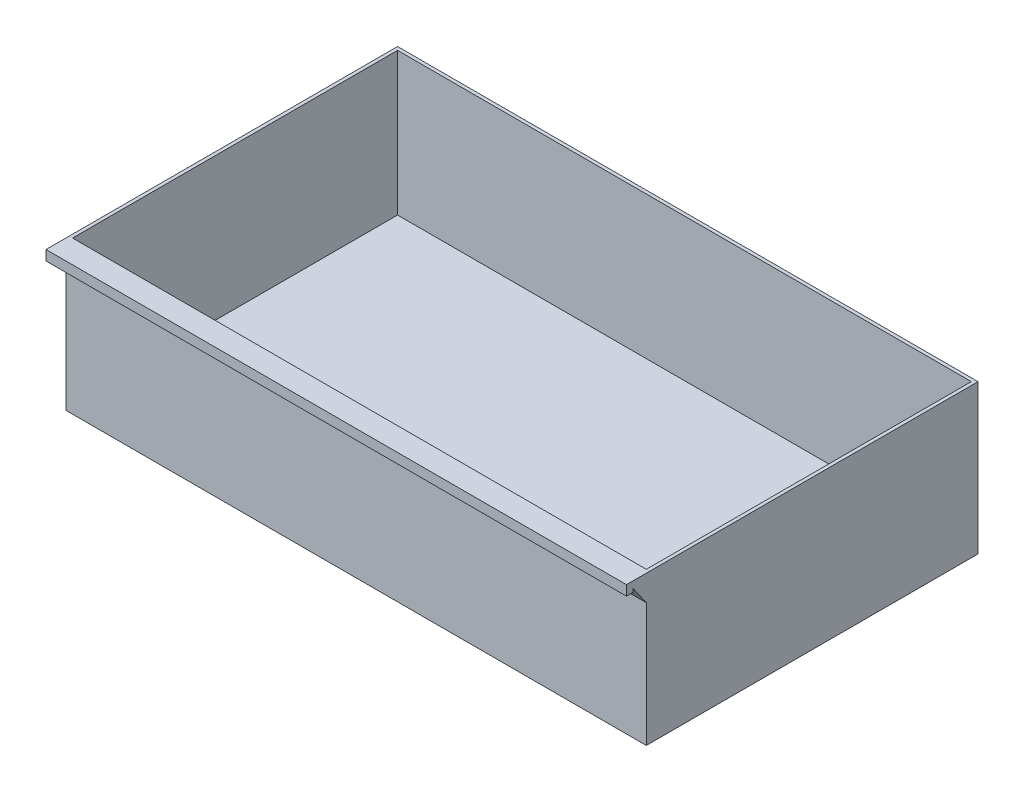
ISO-10303-21;
HEADER;
FILE_DESCRIPTION(('STEP AP214'),'2;1');
FILE_NAME('part.step','',(''),(''),'','','');
FILE_SCHEMA(('AUTOMOTIVE_DESIGN { 1 0 10303 214 1 1 1 1 }'));
ENDSEC;
DATA;
#1=APPLICATION_CONTEXT('core data for automotive mechanical design processes');
#2=APPLICATION_PROTOCOL_DEFINITION('international standard','automotive_design',2000,#1);
#3=PRODUCT_CONTEXT('',#1,'mechanical');
#4=PRODUCT('Part','Part','',(#3));
#5=PRODUCT_RELATED_PRODUCT_CATEGORY('part','',(#4));
#6=PRODUCT_DEFINITION_FORMATION('','',#4);
#7=PRODUCT_DEFINITION_CONTEXT('part definition',#1,'design');
#8=PRODUCT_DEFINITION('design','',#6,#7);
#9=PRODUCT_DEFINITION_SHAPE('','',#8);
#10=(LENGTH_UNIT() NAMED_UNIT(*) SI_UNIT(.MILLI.,.METRE.));
#11=(NAMED_UNIT(*) PLANE_ANGLE_UNIT() SI_UNIT($,.RADIAN.));
#12=(NAMED_UNIT(*) SI_UNIT($,.STERADIAN.) SOLID_ANGLE_UNIT());
#13=UNCERTAINTY_MEASURE_WITH_UNIT(LENGTH_MEASURE(1.E-05),#10,'distance_accuracy_value','');
#14=(GEOMETRIC_REPRESENTATION_CONTEXT(3) GLOBAL_UNCERTAINTY_ASSIGNED_CONTEXT((#13)) GLOBAL_UNIT_ASSIGNED_CONTEXT((#10,
#11,#12)) REPRESENTATION_CONTEXT('',''));
#15=CARTESIAN_POINT('',(0.,0.,0.));
#16=DIRECTION('',(0.,0.,1.));
#17=DIRECTION('',(1.,0.,0.));
#18=AXIS2_PLACEMENT_3D('',#15,#16,#17);
#19=CARTESIAN_POINT('',(-111.125,57.15,-63.5));
#20=DIRECTION('',(1.,0.,0.));
#21=DIRECTION('',(0.,0.,-1.));
#22=AXIS2_PLACEMENT_3D('',#19,#20,#21);
#23=PLANE('',#22);
#24=DIRECTION('',(0.,0.,1.));
#25=VECTOR('',#24,1.);
#26=CARTESIAN_POINT('',(-111.125,0.,-63.5));
#27=LINE('',#26,#25);
#28=CARTESIAN_POINT('',(-111.125,0.,-63.5));
#29=VERTEX_POINT('',#28);
#30=CARTESIAN_POINT('',(-111.125,0.,63.5));
#31=VERTEX_POINT('',#30);
#32=EDGE_CURVE('E195',#29,#31,#27,.T.);
#33=ORIENTED_EDGE('',*,*,#32,.T.);
#34=DIRECTION('',(0.,-1.,0.));
#35=VECTOR('',#34,1.);
#36=CARTESIAN_POINT('',(-111.125,57.15,63.5));
#37=LINE('',#36,#35);
#38=CARTESIAN_POINT('',(-111.125,47.35500812575,63.5));
#39=VERTEX_POINT('',#38);
#40=EDGE_CURVE('E11',#39,#31,#37,.T.);
#41=ORIENTED_EDGE('',*,*,#40,.F.);
#42=DIRECTION('',(0.,0.819152044288995,0.573576436351041));
#43=VECTOR('',#42,1.);
#44=CARTESIAN_POINT('',(-111.125,54.61,68.58));
#45=LINE('',#44,#43);
#46=CARTESIAN_POINT('',(-111.125,54.61,68.58));
#47=VERTEX_POINT('',#46);
#48=EDGE_CURVE('E59',#39,#47,#45,.T.);
#49=ORIENTED_EDGE('',*,*,#48,.T.);
#50=DIRECTION('',(0.,-1.,0.));
#51=VECTOR('',#50,1.);
#52=CARTESIAN_POINT('',(-111.125,53.34,68.58));
#53=LINE('',#52,#51);
#54=CARTESIAN_POINT('',(-111.125,53.34,68.58));
#55=VERTEX_POINT('',#54);
#56=EDGE_CURVE('E142',#47,#55,#53,.T.);
#57=ORIENTED_EDGE('',*,*,#56,.T.);
#58=DIRECTION('',(0.,0.,1.));
#59=VECTOR('',#58,1.);
#60=CARTESIAN_POINT('',(-111.125,53.34,71.12));
#61=LINE('',#60,#59);
#62=CARTESIAN_POINT('',(-111.125,53.34,71.12));
#63=VERTEX_POINT('',#62);
#64=EDGE_CURVE('E148',#55,#63,#61,.T.);
#65=ORIENTED_EDGE('',*,*,#64,.T.);
#66=DIRECTION('',(0.,1.,0.));
#67=VECTOR('',#66,1.);
#68=CARTESIAN_POINT('',(-111.125,57.15,71.12));
#69=LINE('',#68,#67);
#70=CARTESIAN_POINT('',(-111.125,57.15,71.12));
#71=VERTEX_POINT('',#70);
#72=EDGE_CURVE('E158',#63,#71,#69,.T.);
#73=ORIENTED_EDGE('',*,*,#72,.T.);
#74=DIRECTION('',(0.,0.,1.));
#75=VECTOR('',#74,1.);
#76=CARTESIAN_POINT('',(-111.125,57.15,-63.5));
#77=LINE('',#76,#75);
#78=CARTESIAN_POINT('',(-111.125,57.15,-63.5));
#79=VERTEX_POINT('',#78);
#80=EDGE_CURVE('E201',#79,#71,#77,.T.);
#81=ORIENTED_EDGE('',*,*,#80,.F.);
#82=DIRECTION('',(0.,-1.,0.));
#83=VECTOR('',#82,1.);
#84=CARTESIAN_POINT('',(-111.125,57.15,-63.5));
#85=LINE('',#84,#83);
#86=EDGE_CURVE('E208',#79,#29,#85,.T.);
#87=ORIENTED_EDGE('',*,*,#86,.T.);
#88=EDGE_LOOP('',(#33,#41,#49,#57,#65,#73,#81,#87));
#89=FACE_BOUND('',#88,.T.);
#90=ADVANCED_FACE('F45',(#89),#23,.F.);
#91=CARTESIAN_POINT('',(111.125,57.15,63.5));
#92=DIRECTION('',(0.,0.,-1.));
#93=DIRECTION('',(-1.,0.,0.));
#94=AXIS2_PLACEMENT_3D('',#91,#92,#93);
#95=PLANE('',#94);
#96=DIRECTION('',(0.,-1.,0.));
#97=VECTOR('',#96,1.);
#98=CARTESIAN_POINT('',(111.125,57.15,63.5));
#99=LINE('',#98,#97);
#100=CARTESIAN_POINT('',(111.125,47.35500812575,63.5));
#101=VERTEX_POINT('',#100);
#102=CARTESIAN_POINT('',(111.125,0.,63.5));
#103=VERTEX_POINT('',#102);
#104=EDGE_CURVE('E52',#101,#103,#99,.T.);
#105=ORIENTED_EDGE('',*,*,#104,.F.);
#106=DIRECTION('',(-1.,0.,0.));
#107=VECTOR('',#106,1.);
#108=CARTESIAN_POINT('',(123.534926100369,47.35500812575,63.5));
#109=LINE('',#108,#107);
#110=EDGE_CURVE('E139',#101,#39,#109,.T.);
#111=ORIENTED_EDGE('',*,*,#110,.T.);
#112=ORIENTED_EDGE('',*,*,#40,.T.);
#113=DIRECTION('',(1.,0.,0.));
#114=VECTOR('',#113,1.);
#115=CARTESIAN_POINT('',(111.125,0.,63.5));
#116=LINE('',#115,#114);
#117=EDGE_CURVE('E210',#31,#103,#116,.T.);
#118=ORIENTED_EDGE('',*,*,#117,.T.);
#119=EDGE_LOOP('',(#105,#111,#112,#118));
#120=FACE_BOUND('',#119,.T.);
#121=ADVANCED_FACE('F227',(#120),#95,.F.);
#122=CARTESIAN_POINT('',(111.125,57.15,63.5));
#123=DIRECTION('',(-1.,0.,0.));
#124=DIRECTION('',(0.,0.,1.));
#125=AXIS2_PLACEMENT_3D('',#122,#123,#124);
#126=PLANE('',#125);
#127=DIRECTION('',(0.,0.,-1.));
#128=VECTOR('',#127,1.);
#129=CARTESIAN_POINT('',(111.125,0.,63.5));
#130=LINE('',#129,#128);
#131=CARTESIAN_POINT('',(111.125,0.,-63.5));
#132=VERTEX_POINT('',#131);
#133=EDGE_CURVE('E213',#103,#132,#130,.T.);
#134=ORIENTED_EDGE('',*,*,#133,.T.);
#135=DIRECTION('',(0.,-1.,0.));
#136=VECTOR('',#135,1.);
#137=CARTESIAN_POINT('',(111.125,57.15,-63.5));
#138=LINE('',#137,#136);
#139=CARTESIAN_POINT('',(111.125,57.15,-63.5));
#140=VERTEX_POINT('',#139);
#141=EDGE_CURVE('E218',#140,#132,#138,.T.);
#142=ORIENTED_EDGE('',*,*,#141,.F.);
#143=DIRECTION('',(0.,0.,-1.));
#144=VECTOR('',#143,1.);
#145=CARTESIAN_POINT('',(111.125,57.15,63.5));
#146=LINE('',#145,#144);
#147=CARTESIAN_POINT('',(111.125,57.15,71.12));
#148=VERTEX_POINT('',#147);
#149=EDGE_CURVE('E203',#148,#140,#146,.T.);
#150=ORIENTED_EDGE('',*,*,#149,.F.);
#151=DIRECTION('',(0.,-1.,0.));
#152=VECTOR('',#151,1.);
#153=CARTESIAN_POINT('',(111.125,57.15,71.12));
#154=LINE('',#153,#152);
#155=CARTESIAN_POINT('',(111.125,53.34,71.12));
#156=VERTEX_POINT('',#155);
#157=EDGE_CURVE('E154',#148,#156,#154,.T.);
#158=ORIENTED_EDGE('',*,*,#157,.T.);
#159=DIRECTION('',(0.,0.,-1.));
#160=VECTOR('',#159,1.);
#161=CARTESIAN_POINT('',(111.125,53.34,71.12));
#162=LINE('',#161,#160);
#163=CARTESIAN_POINT('',(111.125,53.34,68.58));
#164=VERTEX_POINT('',#163);
#165=EDGE_CURVE('E246',#156,#164,#162,.T.);
#166=ORIENTED_EDGE('',*,*,#165,.T.);
#167=DIRECTION('',(0.,1.,0.));
#168=VECTOR('',#167,1.);
#169=CARTESIAN_POINT('',(111.125,53.34,68.58));
#170=LINE('',#169,#168);
#171=CARTESIAN_POINT('',(111.125,54.61,68.58));
#172=VERTEX_POINT('',#171);
#173=EDGE_CURVE('E164',#164,#172,#170,.T.);
#174=ORIENTED_EDGE('',*,*,#173,.T.);
#175=DIRECTION('',(0.,-0.819152044288995,-0.573576436351042));
#176=VECTOR('',#175,1.);
#177=CARTESIAN_POINT('',(111.125,54.61,68.58));
#178=LINE('',#177,#176);
#179=EDGE_CURVE('E135',#172,#101,#178,.T.);
#180=ORIENTED_EDGE('',*,*,#179,.T.);
#181=ORIENTED_EDGE('',*,*,#104,.T.);
#182=EDGE_LOOP('',(#134,#142,#150,#158,#166,#174,#180,#181));
#183=FACE_BOUND('',#182,.T.);
#184=ADVANCED_FACE('F222',(#183),#126,.F.);
#185=CARTESIAN_POINT('',(111.125,57.15,-63.5));
#186=DIRECTION('',(0.,0.,1.));
#187=DIRECTION('',(1.,0.,0.));
#188=AXIS2_PLACEMENT_3D('',#185,#186,#187);
#189=PLANE('',#188);
#190=DIRECTION('',(-1.,0.,0.));
#191=VECTOR('',#190,1.);
#192=CARTESIAN_POINT('',(111.125,0.,-63.5));
#193=LINE('',#192,#191);
#194=EDGE_CURVE('E204',#132,#29,#193,.T.);
#195=ORIENTED_EDGE('',*,*,#194,.T.);
#196=ORIENTED_EDGE('',*,*,#86,.F.);
#197=DIRECTION('',(-1.,0.,0.));
#198=VECTOR('',#197,1.);
#199=CARTESIAN_POINT('',(111.125,57.15,-63.5));
#200=LINE('',#199,#198);
#201=EDGE_CURVE('E206',#140,#79,#200,.T.);
#202=ORIENTED_EDGE('',*,*,#201,.F.);
#203=ORIENTED_EDGE('',*,*,#141,.T.);
#204=EDGE_LOOP('',(#195,#196,#202,#203));
#205=FACE_BOUND('',#204,.T.);
#206=ADVANCED_FACE('F234',(#205),#189,.F.);
#207=CARTESIAN_POINT('',(0.,57.15,0.));
#208=DIRECTION('',(0.,-1.,0.));
#209=DIRECTION('',(0.,0.,-1.));
#210=AXIS2_PLACEMENT_3D('',#207,#208,#209);
#211=PLANE('',#210);
#212=DIRECTION('',(0.,0.,1.));
#213=VECTOR('',#212,1.);
#214=CARTESIAN_POINT('',(-109.855,57.15,-62.23));
#215=LINE('',#214,#213);
#216=CARTESIAN_POINT('',(-109.855,57.15,-62.23));
#217=VERTEX_POINT('',#216);
#218=CARTESIAN_POINT('',(-109.855,57.15,62.23));
#219=VERTEX_POINT('',#218);
#220=EDGE_CURVE('E185',#217,#219,#215,.T.);
#221=ORIENTED_EDGE('',*,*,#220,.F.);
#222=DIRECTION('',(-1.,0.,0.));
#223=VECTOR('',#222,1.);
#224=CARTESIAN_POINT('',(109.855,57.15,-62.23));
#225=LINE('',#224,#223);
#226=CARTESIAN_POINT('',(109.855,57.15,-62.23));
#227=VERTEX_POINT('',#226);
#228=EDGE_CURVE('E67',#227,#217,#225,.T.);
#229=ORIENTED_EDGE('',*,*,#228,.F.);
#230=DIRECTION('',(0.,0.,-1.));
#231=VECTOR('',#230,1.);
#232=CARTESIAN_POINT('',(109.855,57.15,62.23));
#233=LINE('',#232,#231);
#234=CARTESIAN_POINT('',(109.855,57.15,62.23));
#235=VERTEX_POINT('',#234);
#236=EDGE_CURVE('E174',#235,#227,#233,.T.);
#237=ORIENTED_EDGE('',*,*,#236,.F.);
#238=DIRECTION('',(1.,0.,0.));
#239=VECTOR('',#238,1.);
#240=CARTESIAN_POINT('',(-109.855,57.15,62.23));
#241=LINE('',#240,#239);
#242=EDGE_CURVE('E188',#219,#235,#241,.T.);
#243=ORIENTED_EDGE('',*,*,#242,.F.);
#244=EDGE_LOOP('',(#221,#229,#237,#243));
#245=FACE_BOUND('',#244,.T.);
#246=ORIENTED_EDGE('',*,*,#80,.T.);
#247=DIRECTION('',(-1.,0.,0.));
#248=VECTOR('',#247,1.);
#249=CARTESIAN_POINT('',(123.534926100369,57.15,71.12));
#250=LINE('',#249,#248);
#251=EDGE_CURVE('E161',#148,#71,#250,.T.);
#252=ORIENTED_EDGE('',*,*,#251,.F.);
#253=ORIENTED_EDGE('',*,*,#149,.T.);
#254=ORIENTED_EDGE('',*,*,#201,.T.);
#255=EDGE_LOOP('',(#246,#252,#253,#254));
#256=FACE_BOUND('',#255,.T.);
#257=ADVANCED_FACE('F240',(#245,#256),#211,.F.);
#258=CARTESIAN_POINT('',(0.,0.,0.));
#259=DIRECTION('',(0.,-1.,0.));
#260=DIRECTION('',(0.,0.,-1.));
#261=AXIS2_PLACEMENT_3D('',#258,#259,#260);
#262=PLANE('',#261);
#263=ORIENTED_EDGE('',*,*,#32,.F.);
#264=ORIENTED_EDGE('',*,*,#194,.F.);
#265=ORIENTED_EDGE('',*,*,#133,.F.);
#266=ORIENTED_EDGE('',*,*,#117,.F.);
#267=EDGE_LOOP('',(#263,#264,#265,#266));
#268=FACE_BOUND('',#267,.T.);
#269=ADVANCED_FACE('F231',(#268),#262,.T.);
#270=CARTESIAN_POINT('',(109.855,2.54,-62.23));
#271=DIRECTION('',(0.,0.,-1.));
#272=DIRECTION('',(-1.,0.,0.));
#273=AXIS2_PLACEMENT_3D('',#270,#271,#272);
#274=PLANE('',#273);
#275=ORIENTED_EDGE('',*,*,#228,.T.);
#276=DIRECTION('',(0.,1.,0.));
#277=VECTOR('',#276,1.);
#278=CARTESIAN_POINT('',(-109.855,2.54,-62.23));
#279=LINE('',#278,#277);
#280=CARTESIAN_POINT('',(-109.855,2.54,-62.23));
#281=VERTEX_POINT('',#280);
#282=EDGE_CURVE('E183',#281,#217,#279,.T.);
#283=ORIENTED_EDGE('',*,*,#282,.F.);
#284=DIRECTION('',(-1.,0.,0.));
#285=VECTOR('',#284,1.);
#286=CARTESIAN_POINT('',(109.855,2.54,-62.23));
#287=LINE('',#286,#285);
#288=CARTESIAN_POINT('',(109.855,2.54,-62.23));
#289=VERTEX_POINT('',#288);
#290=EDGE_CURVE('E170',#289,#281,#287,.T.);
#291=ORIENTED_EDGE('',*,*,#290,.F.);
#292=DIRECTION('',(0.,1.,0.));
#293=VECTOR('',#292,1.);
#294=CARTESIAN_POINT('',(109.855,2.54,-62.23));
#295=LINE('',#294,#293);
#296=EDGE_CURVE('E193',#289,#227,#295,.T.);
#297=ORIENTED_EDGE('',*,*,#296,.T.);
#298=EDGE_LOOP('',(#275,#283,#291,#297));
#299=FACE_BOUND('',#298,.T.);
#300=ADVANCED_FACE('F273',(#299),#274,.F.);
#301=CARTESIAN_POINT('',(109.855,2.54,62.23));
#302=DIRECTION('',(1.,0.,0.));
#303=DIRECTION('',(0.,0.,-1.));
#304=AXIS2_PLACEMENT_3D('',#301,#302,#303);
#305=PLANE('',#304);
#306=ORIENTED_EDGE('',*,*,#236,.T.);
#307=ORIENTED_EDGE('',*,*,#296,.F.);
#308=DIRECTION('',(0.,0.,-1.));
#309=VECTOR('',#308,1.);
#310=CARTESIAN_POINT('',(109.855,2.54,62.23));
#311=LINE('',#310,#309);
#312=CARTESIAN_POINT('',(109.855,2.54,62.23));
#313=VERTEX_POINT('',#312);
#314=EDGE_CURVE('E180',#313,#289,#311,.T.);
#315=ORIENTED_EDGE('',*,*,#314,.F.);
#316=DIRECTION('',(0.,1.,0.));
#317=VECTOR('',#316,1.);
#318=CARTESIAN_POINT('',(109.855,2.54,62.23));
#319=LINE('',#318,#317);
#320=EDGE_CURVE('E196',#313,#235,#319,.T.);
#321=ORIENTED_EDGE('',*,*,#320,.T.);
#322=EDGE_LOOP('',(#306,#307,#315,#321));
#323=FACE_BOUND('',#322,.T.);
#324=ADVANCED_FACE('F279',(#323),#305,.F.);
#325=CARTESIAN_POINT('',(-109.855,2.54,62.23));
#326=DIRECTION('',(0.,0.,1.));
#327=DIRECTION('',(1.,0.,0.));
#328=AXIS2_PLACEMENT_3D('',#325,#326,#327);
#329=PLANE('',#328);
#330=ORIENTED_EDGE('',*,*,#242,.T.);
#331=ORIENTED_EDGE('',*,*,#320,.F.);
#332=DIRECTION('',(1.,0.,0.));
#333=VECTOR('',#332,1.);
#334=CARTESIAN_POINT('',(-109.855,2.54,62.23));
#335=LINE('',#334,#333);
#336=CARTESIAN_POINT('',(-109.855,2.54,62.23));
#337=VERTEX_POINT('',#336);
#338=EDGE_CURVE('E177',#337,#313,#335,.T.);
#339=ORIENTED_EDGE('',*,*,#338,.F.);
#340=DIRECTION('',(0.,1.,0.));
#341=VECTOR('',#340,1.);
#342=CARTESIAN_POINT('',(-109.855,2.54,62.23));
#343=LINE('',#342,#341);
#344=EDGE_CURVE('E198',#337,#219,#343,.T.);
#345=ORIENTED_EDGE('',*,*,#344,.T.);
#346=EDGE_LOOP('',(#330,#331,#339,#345));
#347=FACE_BOUND('',#346,.T.);
#348=ADVANCED_FACE('F283',(#347),#329,.F.);
#349=CARTESIAN_POINT('',(-109.855,2.54,-62.23));
#350=DIRECTION('',(-1.,0.,0.));
#351=DIRECTION('',(0.,0.,1.));
#352=AXIS2_PLACEMENT_3D('',#349,#350,#351);
#353=PLANE('',#352);
#354=ORIENTED_EDGE('',*,*,#220,.T.);
#355=ORIENTED_EDGE('',*,*,#344,.F.);
#356=DIRECTION('',(0.,0.,1.));
#357=VECTOR('',#356,1.);
#358=CARTESIAN_POINT('',(-109.855,2.54,-62.23));
#359=LINE('',#358,#357);
#360=EDGE_CURVE('E173',#281,#337,#359,.T.);
#361=ORIENTED_EDGE('',*,*,#360,.F.);
#362=ORIENTED_EDGE('',*,*,#282,.T.);
#363=EDGE_LOOP('',(#354,#355,#361,#362));
#364=FACE_BOUND('',#363,.T.);
#365=ADVANCED_FACE('F280',(#364),#353,.F.);
#366=CARTESIAN_POINT('',(0.,2.54,0.));
#367=DIRECTION('',(0.,1.,0.));
#368=DIRECTION('',(0.,0.,1.));
#369=AXIS2_PLACEMENT_3D('',#366,#367,#368);
#370=PLANE('',#369);
#371=ORIENTED_EDGE('',*,*,#290,.T.);
#372=ORIENTED_EDGE('',*,*,#360,.T.);
#373=ORIENTED_EDGE('',*,*,#338,.T.);
#374=ORIENTED_EDGE('',*,*,#314,.T.);
#375=EDGE_LOOP('',(#371,#372,#373,#374));
#376=FACE_BOUND('',#375,.T.);
#377=ADVANCED_FACE('F257',(#376),#370,.T.);
#378=CARTESIAN_POINT('',(123.534926100369,57.15,71.12));
#379=DIRECTION('',(0.,0.,1.));
#380=DIRECTION('',(1.,0.,0.));
#381=AXIS2_PLACEMENT_3D('',#378,#379,#380);
#382=PLANE('',#381);
#383=ORIENTED_EDGE('',*,*,#157,.F.);
#384=ORIENTED_EDGE('',*,*,#251,.T.);
#385=ORIENTED_EDGE('',*,*,#72,.F.);
#386=DIRECTION('',(-1.,0.,0.));
#387=VECTOR('',#386,1.);
#388=CARTESIAN_POINT('',(123.534926100369,53.34,71.12));
#389=LINE('',#388,#387);
#390=EDGE_CURVE('E165',#156,#63,#389,.T.);
#391=ORIENTED_EDGE('',*,*,#390,.F.);
#392=EDGE_LOOP('',(#383,#384,#385,#391));
#393=FACE_BOUND('',#392,.T.);
#394=ADVANCED_FACE('F243',(#393),#382,.T.);
#395=CARTESIAN_POINT('',(123.534926100369,53.34,71.12));
#396=DIRECTION('',(0.,-1.,0.));
#397=DIRECTION('',(0.,0.,-1.));
#398=AXIS2_PLACEMENT_3D('',#395,#396,#397);
#399=PLANE('',#398);
#400=ORIENTED_EDGE('',*,*,#165,.F.);
#401=ORIENTED_EDGE('',*,*,#390,.T.);
#402=ORIENTED_EDGE('',*,*,#64,.F.);
#403=DIRECTION('',(-1.,0.,0.));
#404=VECTOR('',#403,1.);
#405=CARTESIAN_POINT('',(123.534926100369,53.34,68.58));
#406=LINE('',#405,#404);
#407=EDGE_CURVE('E138',#164,#55,#406,.T.);
#408=ORIENTED_EDGE('',*,*,#407,.F.);
#409=EDGE_LOOP('',(#400,#401,#402,#408));
#410=FACE_BOUND('',#409,.T.);
#411=ADVANCED_FACE('F249',(#410),#399,.T.);
#412=CARTESIAN_POINT('',(123.534926100369,53.34,68.58));
#413=DIRECTION('',(0.,0.,-1.));
#414=DIRECTION('',(-1.,0.,0.));
#415=AXIS2_PLACEMENT_3D('',#412,#413,#414);
#416=PLANE('',#415);
#417=ORIENTED_EDGE('',*,*,#173,.F.);
#418=ORIENTED_EDGE('',*,*,#407,.T.);
#419=ORIENTED_EDGE('',*,*,#56,.F.);
#420=DIRECTION('',(-1.,0.,0.));
#421=VECTOR('',#420,1.);
#422=CARTESIAN_POINT('',(123.534926100369,54.61,68.58));
#423=LINE('',#422,#421);
#424=EDGE_CURVE('E132',#172,#47,#423,.T.);
#425=ORIENTED_EDGE('',*,*,#424,.F.);
#426=EDGE_LOOP('',(#417,#418,#419,#425));
#427=FACE_BOUND('',#426,.T.);
#428=ADVANCED_FACE('F143',(#427),#416,.T.);
#429=CARTESIAN_POINT('',(123.534926100369,54.61,68.58));
#430=DIRECTION('',(0.,-0.573576436351042,0.819152044288995));
#431=DIRECTION('',(0.,-0.819152044288995,-0.573576436351042));
#432=AXIS2_PLACEMENT_3D('',#429,#430,#431);
#433=PLANE('',#432);
#434=ORIENTED_EDGE('',*,*,#179,.F.);
#435=ORIENTED_EDGE('',*,*,#424,.T.);
#436=ORIENTED_EDGE('',*,*,#48,.F.);
#437=ORIENTED_EDGE('',*,*,#110,.F.);
#438=EDGE_LOOP('',(#434,#435,#436,#437));
#439=FACE_BOUND('',#438,.T.);
#440=ADVANCED_FACE('F134',(#439),#433,.T.);
#441=CLOSED_SHELL('',(#90,#121,#184,#206,#257,#269,#300,#324,#348,#365,#377,#394,#411,#428,#440));
#442=MANIFOLD_SOLID_BREP('B2',#441);
#443=ADVANCED_BREP_SHAPE_REPRESENTATION('',(#18,#442),#14);
#444=SHAPE_DEFINITION_REPRESENTATION(#9,#443);
ENDSEC;
END-ISO-10303-21;
